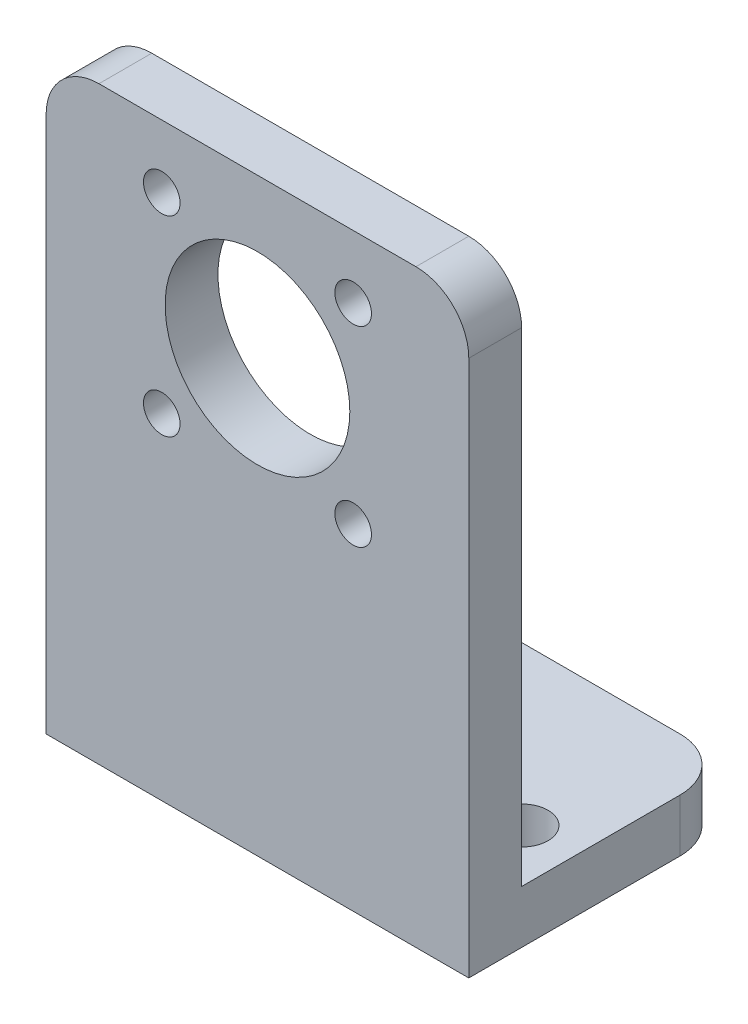
ISO-10303-21;
HEADER;
FILE_DESCRIPTION(('STEP AP214'),'2;1');
FILE_NAME('part.step','',(''),(''),'','','');
FILE_SCHEMA(('AUTOMOTIVE_DESIGN { 1 0 10303 214 1 1 1 1 }'));
ENDSEC;
DATA;
#1=APPLICATION_CONTEXT('core data for automotive mechanical design processes');
#2=APPLICATION_PROTOCOL_DEFINITION('international standard','automotive_design',2000,#1);
#3=PRODUCT_CONTEXT('',#1,'mechanical');
#4=PRODUCT('Part','Part','',(#3));
#5=PRODUCT_RELATED_PRODUCT_CATEGORY('part','',(#4));
#6=PRODUCT_DEFINITION_FORMATION('','',#4);
#7=PRODUCT_DEFINITION_CONTEXT('part definition',#1,'design');
#8=PRODUCT_DEFINITION('design','',#6,#7);
#9=PRODUCT_DEFINITION_SHAPE('','',#8);
#10=(LENGTH_UNIT() NAMED_UNIT(*) SI_UNIT(.MILLI.,.METRE.));
#11=(NAMED_UNIT(*) PLANE_ANGLE_UNIT() SI_UNIT($,.RADIAN.));
#12=(NAMED_UNIT(*) SI_UNIT($,.STERADIAN.) SOLID_ANGLE_UNIT());
#13=UNCERTAINTY_MEASURE_WITH_UNIT(LENGTH_MEASURE(1.E-05),#10,'distance_accuracy_value','');
#14=(GEOMETRIC_REPRESENTATION_CONTEXT(3) GLOBAL_UNCERTAINTY_ASSIGNED_CONTEXT((#13)) GLOBAL_UNIT_ASSIGNED_CONTEXT((#10,
#11,#12)) REPRESENTATION_CONTEXT('',''));
#15=CARTESIAN_POINT('',(0.,0.,0.));
#16=DIRECTION('',(0.,0.,1.));
#17=DIRECTION('',(1.,0.,0.));
#18=AXIS2_PLACEMENT_3D('',#15,#16,#17);
#19=CARTESIAN_POINT('',(0.,0.,0.));
#20=DIRECTION('',(0.,0.,1.));
#21=DIRECTION('',(1.,0.,0.));
#22=AXIS2_PLACEMENT_3D('',#19,#20,#21);
#23=PLANE('',#22);
#24=CARTESIAN_POINT('',(5.75,5.75,0.));
#25=DIRECTION('',(0.,0.,1.));
#26=DIRECTION('',(1.,0.,0.));
#27=AXIS2_PLACEMENT_3D('',#24,#25,#26);
#28=CIRCLE('',#27,1.1);
#29=CARTESIAN_POINT('',(6.85,5.75,0.));
#30=VERTEX_POINT('',#29);
#31=EDGE_CURVE('E355',#30,#30,#28,.T.);
#32=ORIENTED_EDGE('',*,*,#31,.T.);
#33=EDGE_LOOP('',(#32));
#34=FACE_BOUND('',#33,.T.);
#35=CARTESIAN_POINT('',(-5.75,5.75,0.));
#36=DIRECTION('',(0.,0.,1.));
#37=DIRECTION('',(1.,0.,0.));
#38=AXIS2_PLACEMENT_3D('',#35,#36,#37);
#39=CIRCLE('',#38,1.1);
#40=CARTESIAN_POINT('',(-4.65,5.75,0.));
#41=VERTEX_POINT('',#40);
#42=EDGE_CURVE('E39',#41,#41,#39,.T.);
#43=ORIENTED_EDGE('',*,*,#42,.T.);
#44=EDGE_LOOP('',(#43));
#45=FACE_BOUND('',#44,.T.);
#46=CARTESIAN_POINT('',(5.75,-5.75,0.));
#47=DIRECTION('',(0.,0.,1.));
#48=DIRECTION('',(1.,0.,0.));
#49=AXIS2_PLACEMENT_3D('',#46,#47,#48);
#50=CIRCLE('',#49,1.1);
#51=CARTESIAN_POINT('',(6.85,-5.75,0.));
#52=VERTEX_POINT('',#51);
#53=EDGE_CURVE('E345',#52,#52,#50,.T.);
#54=ORIENTED_EDGE('',*,*,#53,.T.);
#55=EDGE_LOOP('',(#54));
#56=FACE_BOUND('',#55,.T.);
#57=CARTESIAN_POINT('',(-5.75,-5.75,0.));
#58=DIRECTION('',(0.,0.,1.));
#59=DIRECTION('',(1.,0.,0.));
#60=AXIS2_PLACEMENT_3D('',#57,#58,#59);
#61=CIRCLE('',#60,1.1);
#62=CARTESIAN_POINT('',(-4.65,-5.75,0.));
#63=VERTEX_POINT('',#62);
#64=EDGE_CURVE('E140',#63,#63,#61,.T.);
#65=ORIENTED_EDGE('',*,*,#64,.T.);
#66=EDGE_LOOP('',(#65));
#67=FACE_BOUND('',#66,.T.);
#68=CARTESIAN_POINT('',(0.,0.,0.));
#69=DIRECTION('',(0.,0.,1.));
#70=DIRECTION('',(1.,0.,0.));
#71=AXIS2_PLACEMENT_3D('',#68,#69,#70);
#72=CIRCLE('',#71,5.55);
#73=CARTESIAN_POINT('',(5.55,0.,0.));
#74=VERTEX_POINT('',#73);
#75=EDGE_CURVE('E150',#74,#74,#72,.T.);
#76=ORIENTED_EDGE('',*,*,#75,.T.);
#77=EDGE_LOOP('',(#76));
#78=FACE_BOUND('',#77,.T.);
#79=DIRECTION('',(0.,-1.,0.));
#80=VECTOR('',#79,1.);
#81=CARTESIAN_POINT('',(-12.7,9.525,0.));
#82=LINE('',#81,#80);
#83=CARTESIAN_POINT('',(-12.7,6.35,0.));
#84=VERTEX_POINT('',#83);
#85=CARTESIAN_POINT('',(-12.7,-22.733,0.));
#86=VERTEX_POINT('',#85);
#87=EDGE_CURVE('E134',#84,#86,#82,.T.);
#88=ORIENTED_EDGE('',*,*,#87,.F.);
#89=CARTESIAN_POINT('',(-9.525,6.35,0.));
#90=DIRECTION('',(0.,0.,1.));
#91=DIRECTION('',(1.,0.,0.));
#92=AXIS2_PLACEMENT_3D('',#89,#90,#91);
#93=CIRCLE('',#92,3.175);
#94=CARTESIAN_POINT('',(-9.525,9.525,0.));
#95=VERTEX_POINT('',#94);
#96=EDGE_CURVE('E194',#84,#95,#93,.F.);
#97=ORIENTED_EDGE('',*,*,#96,.T.);
#98=DIRECTION('',(-1.,0.,0.));
#99=VECTOR('',#98,1.);
#100=CARTESIAN_POINT('',(-12.7,9.525,0.));
#101=LINE('',#100,#99);
#102=CARTESIAN_POINT('',(9.525,9.525,0.));
#103=VERTEX_POINT('',#102);
#104=EDGE_CURVE('E133',#103,#95,#101,.T.);
#105=ORIENTED_EDGE('',*,*,#104,.F.);
#106=CARTESIAN_POINT('',(9.525,6.35,0.));
#107=DIRECTION('',(0.,0.,1.));
#108=DIRECTION('',(1.,0.,0.));
#109=AXIS2_PLACEMENT_3D('',#106,#107,#108);
#110=CIRCLE('',#109,3.175);
#111=CARTESIAN_POINT('',(12.7,6.35,0.));
#112=VERTEX_POINT('',#111);
#113=EDGE_CURVE('E132',#103,#112,#110,.F.);
#114=ORIENTED_EDGE('',*,*,#113,.T.);
#115=DIRECTION('',(0.,1.,0.));
#116=VECTOR('',#115,1.);
#117=CARTESIAN_POINT('',(12.7,9.525,0.));
#118=LINE('',#117,#116);
#119=CARTESIAN_POINT('',(12.7,-22.733,0.));
#120=VERTEX_POINT('',#119);
#121=EDGE_CURVE('E117',#120,#112,#118,.T.);
#122=ORIENTED_EDGE('',*,*,#121,.F.);
#123=DIRECTION('',(1.,0.,0.));
#124=VECTOR('',#123,1.);
#125=CARTESIAN_POINT('',(-12.7,-22.733,0.));
#126=LINE('',#125,#124);
#127=EDGE_CURVE('E130',#86,#120,#126,.T.);
#128=ORIENTED_EDGE('',*,*,#127,.F.);
#129=EDGE_LOOP('',(#88,#97,#105,#114,#122,#128));
#130=FACE_BOUND('',#129,.T.);
#131=ADVANCED_FACE('F35',(#34,#45,#56,#67,#78,#130),#23,.F.);
#132=CARTESIAN_POINT('',(0.,0.,3.175));
#133=DIRECTION('',(0.,0.,1.));
#134=DIRECTION('',(1.,0.,0.));
#135=AXIS2_PLACEMENT_3D('',#132,#133,#134);
#136=PLANE('',#135);
#137=CARTESIAN_POINT('',(5.75,5.75,3.175));
#138=DIRECTION('',(0.,0.,1.));
#139=DIRECTION('',(1.,0.,0.));
#140=AXIS2_PLACEMENT_3D('',#137,#138,#139);
#141=CIRCLE('',#140,1.1);
#142=CARTESIAN_POINT('',(6.85,5.75,3.175));
#143=VERTEX_POINT('',#142);
#144=EDGE_CURVE('E357',#143,#143,#141,.T.);
#145=ORIENTED_EDGE('',*,*,#144,.F.);
#146=EDGE_LOOP('',(#145));
#147=FACE_BOUND('',#146,.T.);
#148=CARTESIAN_POINT('',(-5.75,5.75,3.175));
#149=DIRECTION('',(0.,0.,1.));
#150=DIRECTION('',(1.,0.,0.));
#151=AXIS2_PLACEMENT_3D('',#148,#149,#150);
#152=CIRCLE('',#151,1.1);
#153=CARTESIAN_POINT('',(-4.65,5.75,3.175));
#154=VERTEX_POINT('',#153);
#155=EDGE_CURVE('E352',#154,#154,#152,.T.);
#156=ORIENTED_EDGE('',*,*,#155,.F.);
#157=EDGE_LOOP('',(#156));
#158=FACE_BOUND('',#157,.T.);
#159=CARTESIAN_POINT('',(5.75,-5.75,3.175));
#160=DIRECTION('',(0.,0.,1.));
#161=DIRECTION('',(1.,0.,0.));
#162=AXIS2_PLACEMENT_3D('',#159,#160,#161);
#163=CIRCLE('',#162,1.1);
#164=CARTESIAN_POINT('',(6.85,-5.75,3.175));
#165=VERTEX_POINT('',#164);
#166=EDGE_CURVE('E342',#165,#165,#163,.T.);
#167=ORIENTED_EDGE('',*,*,#166,.F.);
#168=EDGE_LOOP('',(#167));
#169=FACE_BOUND('',#168,.T.);
#170=CARTESIAN_POINT('',(-5.75,-5.75,3.175));
#171=DIRECTION('',(0.,0.,1.));
#172=DIRECTION('',(1.,0.,0.));
#173=AXIS2_PLACEMENT_3D('',#170,#171,#172);
#174=CIRCLE('',#173,1.1);
#175=CARTESIAN_POINT('',(-4.65,-5.75,3.175));
#176=VERTEX_POINT('',#175);
#177=EDGE_CURVE('E145',#176,#176,#174,.T.);
#178=ORIENTED_EDGE('',*,*,#177,.F.);
#179=EDGE_LOOP('',(#178));
#180=FACE_BOUND('',#179,.T.);
#181=DIRECTION('',(-1.,0.,0.));
#182=VECTOR('',#181,1.);
#183=CARTESIAN_POINT('',(-12.7,9.525,3.175));
#184=LINE('',#183,#182);
#185=CARTESIAN_POINT('',(9.525,9.525,3.175));
#186=VERTEX_POINT('',#185);
#187=CARTESIAN_POINT('',(-9.525,9.525,3.175));
#188=VERTEX_POINT('',#187);
#189=EDGE_CURVE('E162',#186,#188,#184,.T.);
#190=ORIENTED_EDGE('',*,*,#189,.T.);
#191=CARTESIAN_POINT('',(-9.525,6.35,3.175));
#192=DIRECTION('',(0.,0.,1.));
#193=DIRECTION('',(1.,0.,0.));
#194=AXIS2_PLACEMENT_3D('',#191,#192,#193);
#195=CIRCLE('',#194,3.175);
#196=CARTESIAN_POINT('',(-12.7,6.35,3.175));
#197=VERTEX_POINT('',#196);
#198=EDGE_CURVE('E11',#188,#197,#195,.T.);
#199=ORIENTED_EDGE('',*,*,#198,.T.);
#200=DIRECTION('',(0.,-1.,0.));
#201=VECTOR('',#200,1.);
#202=CARTESIAN_POINT('',(-12.7,9.525,3.175));
#203=LINE('',#202,#201);
#204=CARTESIAN_POINT('',(-12.7,-25.908,3.175));
#205=VERTEX_POINT('',#204);
#206=EDGE_CURVE('E156',#197,#205,#203,.T.);
#207=ORIENTED_EDGE('',*,*,#206,.T.);
#208=DIRECTION('',(1.,0.,0.));
#209=VECTOR('',#208,1.);
#210=CARTESIAN_POINT('',(-12.7,-25.908,3.175));
#211=LINE('',#210,#209);
#212=CARTESIAN_POINT('',(12.7,-25.908,3.175));
#213=VERTEX_POINT('',#212);
#214=EDGE_CURVE('E158',#205,#213,#211,.T.);
#215=ORIENTED_EDGE('',*,*,#214,.T.);
#216=DIRECTION('',(0.,1.,0.));
#217=VECTOR('',#216,1.);
#218=CARTESIAN_POINT('',(12.7,9.525,3.175));
#219=LINE('',#218,#217);
#220=CARTESIAN_POINT('',(12.7,6.35,3.175));
#221=VERTEX_POINT('',#220);
#222=EDGE_CURVE('E160',#213,#221,#219,.T.);
#223=ORIENTED_EDGE('',*,*,#222,.T.);
#224=CARTESIAN_POINT('',(9.525,6.35,3.175));
#225=DIRECTION('',(0.,0.,1.));
#226=DIRECTION('',(1.,0.,0.));
#227=AXIS2_PLACEMENT_3D('',#224,#225,#226);
#228=CIRCLE('',#227,3.175);
#229=EDGE_CURVE('E44',#221,#186,#228,.T.);
#230=ORIENTED_EDGE('',*,*,#229,.T.);
#231=EDGE_LOOP('',(#190,#199,#207,#215,#223,#230));
#232=FACE_BOUND('',#231,.T.);
#233=CARTESIAN_POINT('',(0.,0.,3.175));
#234=DIRECTION('',(0.,0.,1.));
#235=DIRECTION('',(1.,0.,0.));
#236=AXIS2_PLACEMENT_3D('',#233,#234,#235);
#237=CIRCLE('',#236,5.55);
#238=CARTESIAN_POINT('',(5.55,0.,3.175));
#239=VERTEX_POINT('',#238);
#240=EDGE_CURVE('E151',#239,#239,#237,.T.);
#241=ORIENTED_EDGE('',*,*,#240,.F.);
#242=EDGE_LOOP('',(#241));
#243=FACE_BOUND('',#242,.T.);
#244=ADVANCED_FACE('F212',(#147,#158,#169,#180,#232,#243),#136,.T.);
#245=CARTESIAN_POINT('',(-12.7,9.525,3.175));
#246=DIRECTION('',(1.,0.,0.));
#247=DIRECTION('',(0.,1.,0.));
#248=AXIS2_PLACEMENT_3D('',#245,#246,#247);
#249=PLANE('',#248);
#250=DIRECTION('',(0.,0.,1.));
#251=VECTOR('',#250,1.);
#252=CARTESIAN_POINT('',(-12.7,-22.733,-12.7));
#253=LINE('',#252,#251);
#254=CARTESIAN_POINT('',(-12.7,-22.733,-9.525));
#255=VERTEX_POINT('',#254);
#256=EDGE_CURVE('E124',#255,#86,#253,.T.);
#257=ORIENTED_EDGE('',*,*,#256,.F.);
#258=DIRECTION('',(0.,1.,0.));
#259=VECTOR('',#258,1.);
#260=CARTESIAN_POINT('',(-12.7,-25.908,-9.525));
#261=LINE('',#260,#259);
#262=CARTESIAN_POINT('',(-12.7,-25.908,-9.525));
#263=VERTEX_POINT('',#262);
#264=EDGE_CURVE('E191',#255,#263,#261,.F.);
#265=ORIENTED_EDGE('',*,*,#264,.T.);
#266=DIRECTION('',(0.,0.,-1.));
#267=VECTOR('',#266,1.);
#268=CARTESIAN_POINT('',(-12.7,-25.908,3.175));
#269=LINE('',#268,#267);
#270=EDGE_CURVE('E168',#205,#263,#269,.T.);
#271=ORIENTED_EDGE('',*,*,#270,.F.);
#272=ORIENTED_EDGE('',*,*,#206,.F.);
#273=DIRECTION('',(0.,0.,-1.));
#274=VECTOR('',#273,1.);
#275=CARTESIAN_POINT('',(-12.7,6.35,3.175));
#276=LINE('',#275,#274);
#277=EDGE_CURVE('E188',#197,#84,#276,.T.);
#278=ORIENTED_EDGE('',*,*,#277,.T.);
#279=ORIENTED_EDGE('',*,*,#87,.T.);
#280=EDGE_LOOP('',(#257,#265,#271,#272,#278,#279));
#281=FACE_BOUND('',#280,.T.);
#282=ADVANCED_FACE('F209',(#281),#249,.F.);
#283=CARTESIAN_POINT('',(-12.7,-25.908,3.175));
#284=DIRECTION('',(0.,1.,0.));
#285=DIRECTION('',(-1.,0.,0.));
#286=AXIS2_PLACEMENT_3D('',#283,#284,#285);
#287=PLANE('',#286);
#288=CARTESIAN_POINT('',(9.525,-25.908,-3.175));
#289=DIRECTION('',(0.,1.,0.));
#290=DIRECTION('',(-1.,0.,0.));
#291=AXIS2_PLACEMENT_3D('',#288,#289,#290);
#292=CIRCLE('',#291,1.5875);
#293=CARTESIAN_POINT('',(7.9375,-25.908,-3.175));
#294=VERTEX_POINT('',#293);
#295=EDGE_CURVE('E372',#294,#294,#292,.T.);
#296=ORIENTED_EDGE('',*,*,#295,.T.);
#297=EDGE_LOOP('',(#296));
#298=FACE_BOUND('',#297,.T.);
#299=CARTESIAN_POINT('',(-9.525,-25.908,-3.175));
#300=DIRECTION('',(0.,1.,0.));
#301=DIRECTION('',(-1.,0.,0.));
#302=AXIS2_PLACEMENT_3D('',#299,#300,#301);
#303=CIRCLE('',#302,1.5875);
#304=CARTESIAN_POINT('',(-11.1125,-25.908,-3.175));
#305=VERTEX_POINT('',#304);
#306=EDGE_CURVE('E366',#305,#305,#303,.T.);
#307=ORIENTED_EDGE('',*,*,#306,.T.);
#308=EDGE_LOOP('',(#307));
#309=FACE_BOUND('',#308,.T.);
#310=CARTESIAN_POINT('',(0.,-25.908,-9.525));
#311=DIRECTION('',(0.,1.,0.));
#312=DIRECTION('',(0.,0.,1.));
#313=AXIS2_PLACEMENT_3D('',#310,#311,#312);
#314=CIRCLE('',#313,1.47319999999999);
#315=CARTESIAN_POINT('',(0.,-25.908,-8.05180000000001));
#316=VERTEX_POINT('',#315);
#317=EDGE_CURVE('E360',#316,#316,#314,.T.);
#318=ORIENTED_EDGE('',*,*,#317,.T.);
#319=EDGE_LOOP('',(#318));
#320=FACE_BOUND('',#319,.T.);
#321=DIRECTION('',(-1.,0.,0.));
#322=VECTOR('',#321,1.);
#323=CARTESIAN_POINT('',(-12.7,-25.908,-12.7));
#324=LINE('',#323,#322);
#325=CARTESIAN_POINT('',(9.525,-25.908,-12.7));
#326=VERTEX_POINT('',#325);
#327=CARTESIAN_POINT('',(-9.525,-25.908,-12.7));
#328=VERTEX_POINT('',#327);
#329=EDGE_CURVE('E125',#326,#328,#324,.T.);
#330=ORIENTED_EDGE('',*,*,#329,.F.);
#331=CARTESIAN_POINT('',(9.525,-25.908,-9.525));
#332=DIRECTION('',(0.,1.,0.));
#333=DIRECTION('',(-1.,0.,0.));
#334=AXIS2_PLACEMENT_3D('',#331,#332,#333);
#335=CIRCLE('',#334,3.175);
#336=CARTESIAN_POINT('',(12.7,-25.908,-9.525));
#337=VERTEX_POINT('',#336);
#338=EDGE_CURVE('E179',#326,#337,#335,.F.);
#339=ORIENTED_EDGE('',*,*,#338,.T.);
#340=DIRECTION('',(0.,0.,-1.));
#341=VECTOR('',#340,1.);
#342=CARTESIAN_POINT('',(12.7,-25.908,3.175));
#343=LINE('',#342,#341);
#344=EDGE_CURVE('E164',#213,#337,#343,.T.);
#345=ORIENTED_EDGE('',*,*,#344,.F.);
#346=ORIENTED_EDGE('',*,*,#214,.F.);
#347=ORIENTED_EDGE('',*,*,#270,.T.);
#348=CARTESIAN_POINT('',(-9.525,-25.908,-9.525));
#349=DIRECTION('',(0.,1.,0.));
#350=DIRECTION('',(-1.,0.,0.));
#351=AXIS2_PLACEMENT_3D('',#348,#349,#350);
#352=CIRCLE('',#351,3.175);
#353=EDGE_CURVE('E177',#263,#328,#352,.F.);
#354=ORIENTED_EDGE('',*,*,#353,.T.);
#355=EDGE_LOOP('',(#330,#339,#345,#346,#347,#354));
#356=FACE_BOUND('',#355,.T.);
#357=ADVANCED_FACE('F217',(#298,#309,#320,#356),#287,.F.);
#358=CARTESIAN_POINT('',(12.7,9.525,3.175));
#359=DIRECTION('',(-1.,0.,0.));
#360=DIRECTION('',(0.,-1.,0.));
#361=AXIS2_PLACEMENT_3D('',#358,#359,#360);
#362=PLANE('',#361);
#363=ORIENTED_EDGE('',*,*,#344,.T.);
#364=DIRECTION('',(0.,-1.,0.));
#365=VECTOR('',#364,1.);
#366=CARTESIAN_POINT('',(12.7,-22.733,-9.525));
#367=LINE('',#366,#365);
#368=CARTESIAN_POINT('',(12.7,-22.733,-9.525));
#369=VERTEX_POINT('',#368);
#370=EDGE_CURVE('E120',#337,#369,#367,.F.);
#371=ORIENTED_EDGE('',*,*,#370,.T.);
#372=DIRECTION('',(0.,0.,1.));
#373=VECTOR('',#372,1.);
#374=CARTESIAN_POINT('',(12.7,-22.733,-12.7));
#375=LINE('',#374,#373);
#376=EDGE_CURVE('E113',#369,#120,#375,.T.);
#377=ORIENTED_EDGE('',*,*,#376,.T.);
#378=ORIENTED_EDGE('',*,*,#121,.T.);
#379=DIRECTION('',(0.,0.,-1.));
#380=VECTOR('',#379,1.);
#381=CARTESIAN_POINT('',(12.7,6.35,3.175));
#382=LINE('',#381,#380);
#383=EDGE_CURVE('E181',#112,#221,#382,.F.);
#384=ORIENTED_EDGE('',*,*,#383,.T.);
#385=ORIENTED_EDGE('',*,*,#222,.F.);
#386=EDGE_LOOP('',(#363,#371,#377,#378,#384,#385));
#387=FACE_BOUND('',#386,.T.);
#388=ADVANCED_FACE('F116',(#387),#362,.F.);
#389=CARTESIAN_POINT('',(-12.7,9.525,3.175));
#390=DIRECTION('',(0.,-1.,0.));
#391=DIRECTION('',(1.,0.,0.));
#392=AXIS2_PLACEMENT_3D('',#389,#390,#391);
#393=PLANE('',#392);
#394=ORIENTED_EDGE('',*,*,#104,.T.);
#395=DIRECTION('',(0.,0.,-1.));
#396=VECTOR('',#395,1.);
#397=CARTESIAN_POINT('',(-9.525,9.525,3.175));
#398=LINE('',#397,#396);
#399=EDGE_CURVE('E51',#95,#188,#398,.F.);
#400=ORIENTED_EDGE('',*,*,#399,.T.);
#401=ORIENTED_EDGE('',*,*,#189,.F.);
#402=DIRECTION('',(0.,0.,-1.));
#403=VECTOR('',#402,1.);
#404=CARTESIAN_POINT('',(9.525,9.525,3.175));
#405=LINE('',#404,#403);
#406=EDGE_CURVE('E196',#186,#103,#405,.T.);
#407=ORIENTED_EDGE('',*,*,#406,.T.);
#408=EDGE_LOOP('',(#394,#400,#401,#407));
#409=FACE_BOUND('',#408,.T.);
#410=ADVANCED_FACE('F201',(#409),#393,.F.);
#411=CARTESIAN_POINT('',(0.,0.,3.175));
#412=DIRECTION('',(0.,0.,-1.));
#413=DIRECTION('',(-1.,0.,0.));
#414=AXIS2_PLACEMENT_3D('',#411,#412,#413);
#415=CYLINDRICAL_SURFACE('',#414,5.55);
#416=ORIENTED_EDGE('',*,*,#240,.T.);
#417=EDGE_LOOP('',(#416));
#418=FACE_BOUND('',#417,.T.);
#419=ORIENTED_EDGE('',*,*,#75,.F.);
#420=EDGE_LOOP('',(#419));
#421=FACE_BOUND('',#420,.T.);
#422=ADVANCED_FACE('F244',(#418,#421),#415,.F.);
#423=CARTESIAN_POINT('',(-12.7,-22.733,-12.7));
#424=DIRECTION('',(0.,-1.,0.));
#425=DIRECTION('',(1.,0.,0.));
#426=AXIS2_PLACEMENT_3D('',#423,#424,#425);
#427=PLANE('',#426);
#428=CARTESIAN_POINT('',(9.525,-22.733,-3.175));
#429=DIRECTION('',(0.,1.,0.));
#430=DIRECTION('',(0.,0.,1.));
#431=AXIS2_PLACEMENT_3D('',#428,#429,#430);
#432=CIRCLE('',#431,1.5875);
#433=CARTESIAN_POINT('',(9.525,-22.733,-1.5875));
#434=VERTEX_POINT('',#433);
#435=EDGE_CURVE('E375',#434,#434,#432,.T.);
#436=ORIENTED_EDGE('',*,*,#435,.F.);
#437=EDGE_LOOP('',(#436));
#438=FACE_BOUND('',#437,.T.);
#439=CARTESIAN_POINT('',(-9.525,-22.733,-3.175));
#440=DIRECTION('',(0.,1.,0.));
#441=DIRECTION('',(0.,0.,1.));
#442=AXIS2_PLACEMENT_3D('',#439,#440,#441);
#443=CIRCLE('',#442,1.5875);
#444=CARTESIAN_POINT('',(-9.525,-22.733,-1.5875));
#445=VERTEX_POINT('',#444);
#446=EDGE_CURVE('E369',#445,#445,#443,.T.);
#447=ORIENTED_EDGE('',*,*,#446,.F.);
#448=EDGE_LOOP('',(#447));
#449=FACE_BOUND('',#448,.T.);
#450=CARTESIAN_POINT('',(0.,-22.733,-9.525));
#451=DIRECTION('',(0.,1.,0.));
#452=DIRECTION('',(0.,0.,1.));
#453=AXIS2_PLACEMENT_3D('',#450,#451,#452);
#454=CIRCLE('',#453,1.47319999999999);
#455=CARTESIAN_POINT('',(0.,-22.733,-8.05180000000001));
#456=VERTEX_POINT('',#455);
#457=EDGE_CURVE('E363',#456,#456,#454,.T.);
#458=ORIENTED_EDGE('',*,*,#457,.F.);
#459=EDGE_LOOP('',(#458));
#460=FACE_BOUND('',#459,.T.);
#461=ORIENTED_EDGE('',*,*,#376,.F.);
#462=CARTESIAN_POINT('',(9.525,-22.733,-9.525));
#463=DIRECTION('',(0.,-1.,0.));
#464=DIRECTION('',(1.,0.,0.));
#465=AXIS2_PLACEMENT_3D('',#462,#463,#464);
#466=CIRCLE('',#465,3.175);
#467=CARTESIAN_POINT('',(9.525,-22.733,-12.7));
#468=VERTEX_POINT('',#467);
#469=EDGE_CURVE('E186',#369,#468,#466,.F.);
#470=ORIENTED_EDGE('',*,*,#469,.T.);
#471=DIRECTION('',(1.,0.,0.));
#472=VECTOR('',#471,1.);
#473=CARTESIAN_POINT('',(-12.7,-22.733,-12.7));
#474=LINE('',#473,#472);
#475=CARTESIAN_POINT('',(-9.525,-22.733,-12.7));
#476=VERTEX_POINT('',#475);
#477=EDGE_CURVE('E139',#476,#468,#474,.T.);
#478=ORIENTED_EDGE('',*,*,#477,.F.);
#479=CARTESIAN_POINT('',(-9.525,-22.733,-9.525));
#480=DIRECTION('',(0.,-1.,0.));
#481=DIRECTION('',(1.,0.,0.));
#482=AXIS2_PLACEMENT_3D('',#479,#480,#481);
#483=CIRCLE('',#482,3.175);
#484=EDGE_CURVE('E184',#476,#255,#483,.F.);
#485=ORIENTED_EDGE('',*,*,#484,.T.);
#486=ORIENTED_EDGE('',*,*,#256,.T.);
#487=ORIENTED_EDGE('',*,*,#127,.T.);
#488=EDGE_LOOP('',(#461,#470,#478,#485,#486,#487));
#489=FACE_BOUND('',#488,.T.);
#490=ADVANCED_FACE('F137',(#438,#449,#460,#489),#427,.F.);
#491=CARTESIAN_POINT('',(0.,0.,-12.7));
#492=DIRECTION('',(0.,0.,-1.));
#493=DIRECTION('',(-1.,0.,0.));
#494=AXIS2_PLACEMENT_3D('',#491,#492,#493);
#495=PLANE('',#494);
#496=ORIENTED_EDGE('',*,*,#477,.T.);
#497=DIRECTION('',(0.,-1.,0.));
#498=VECTOR('',#497,1.);
#499=CARTESIAN_POINT('',(9.525,-25.908,-12.7));
#500=LINE('',#499,#498);
#501=EDGE_CURVE('E174',#468,#326,#500,.T.);
#502=ORIENTED_EDGE('',*,*,#501,.T.);
#503=ORIENTED_EDGE('',*,*,#329,.T.);
#504=DIRECTION('',(0.,1.,0.));
#505=VECTOR('',#504,1.);
#506=CARTESIAN_POINT('',(-9.525,-22.733,-12.7));
#507=LINE('',#506,#505);
#508=EDGE_CURVE('E171',#328,#476,#507,.T.);
#509=ORIENTED_EDGE('',*,*,#508,.T.);
#510=EDGE_LOOP('',(#496,#502,#503,#509));
#511=FACE_BOUND('',#510,.T.);
#512=ADVANCED_FACE('F255',(#511),#495,.T.);
#513=CARTESIAN_POINT('',(9.525,0.,-9.525));
#514=DIRECTION('',(0.,1.,0.));
#515=DIRECTION('',(-1.,0.,0.));
#516=AXIS2_PLACEMENT_3D('',#513,#514,#515);
#517=CYLINDRICAL_SURFACE('',#516,3.175);
#518=ORIENTED_EDGE('',*,*,#469,.F.);
#519=ORIENTED_EDGE('',*,*,#370,.F.);
#520=ORIENTED_EDGE('',*,*,#338,.F.);
#521=ORIENTED_EDGE('',*,*,#501,.F.);
#522=EDGE_LOOP('',(#518,#519,#520,#521));
#523=FACE_BOUND('',#522,.T.);
#524=ADVANCED_FACE('F252',(#523),#517,.T.);
#525=CARTESIAN_POINT('',(-9.525,0.,-9.525));
#526=DIRECTION('',(0.,-1.,0.));
#527=DIRECTION('',(1.,0.,0.));
#528=AXIS2_PLACEMENT_3D('',#525,#526,#527);
#529=CYLINDRICAL_SURFACE('',#528,3.175);
#530=ORIENTED_EDGE('',*,*,#353,.F.);
#531=ORIENTED_EDGE('',*,*,#264,.F.);
#532=ORIENTED_EDGE('',*,*,#484,.F.);
#533=ORIENTED_EDGE('',*,*,#508,.F.);
#534=EDGE_LOOP('',(#530,#531,#532,#533));
#535=FACE_BOUND('',#534,.T.);
#536=ADVANCED_FACE('F229',(#535),#529,.T.);
#537=CARTESIAN_POINT('',(-9.525,6.35,3.175));
#538=DIRECTION('',(0.,0.,-1.));
#539=DIRECTION('',(-1.,0.,0.));
#540=AXIS2_PLACEMENT_3D('',#537,#538,#539);
#541=CYLINDRICAL_SURFACE('',#540,3.175);
#542=ORIENTED_EDGE('',*,*,#198,.F.);
#543=ORIENTED_EDGE('',*,*,#399,.F.);
#544=ORIENTED_EDGE('',*,*,#96,.F.);
#545=ORIENTED_EDGE('',*,*,#277,.F.);
#546=EDGE_LOOP('',(#542,#543,#544,#545));
#547=FACE_BOUND('',#546,.T.);
#548=ADVANCED_FACE('F206',(#547),#541,.T.);
#549=CARTESIAN_POINT('',(9.525,6.35,3.175));
#550=DIRECTION('',(0.,0.,-1.));
#551=DIRECTION('',(-1.,0.,0.));
#552=AXIS2_PLACEMENT_3D('',#549,#550,#551);
#553=CYLINDRICAL_SURFACE('',#552,3.175);
#554=ORIENTED_EDGE('',*,*,#229,.F.);
#555=ORIENTED_EDGE('',*,*,#383,.F.);
#556=ORIENTED_EDGE('',*,*,#113,.F.);
#557=ORIENTED_EDGE('',*,*,#406,.F.);
#558=EDGE_LOOP('',(#554,#555,#556,#557));
#559=FACE_BOUND('',#558,.T.);
#560=ADVANCED_FACE('F37',(#559),#553,.T.);
#561=CARTESIAN_POINT('',(-5.75,-5.75,3.175));
#562=DIRECTION('',(0.,0.,1.));
#563=DIRECTION('',(1.,0.,0.));
#564=AXIS2_PLACEMENT_3D('',#561,#562,#563);
#565=CYLINDRICAL_SURFACE('',#564,1.1);
#566=ORIENTED_EDGE('',*,*,#177,.T.);
#567=EDGE_LOOP('',(#566));
#568=FACE_BOUND('',#567,.T.);
#569=ORIENTED_EDGE('',*,*,#64,.F.);
#570=EDGE_LOOP('',(#569));
#571=FACE_BOUND('',#570,.T.);
#572=ADVANCED_FACE('F221',(#568,#571),#565,.F.);
#573=CARTESIAN_POINT('',(5.75,-5.75,3.175));
#574=DIRECTION('',(0.,0.,1.));
#575=DIRECTION('',(1.,0.,0.));
#576=AXIS2_PLACEMENT_3D('',#573,#574,#575);
#577=CYLINDRICAL_SURFACE('',#576,1.1);
#578=ORIENTED_EDGE('',*,*,#166,.T.);
#579=EDGE_LOOP('',(#578));
#580=FACE_BOUND('',#579,.T.);
#581=ORIENTED_EDGE('',*,*,#53,.F.);
#582=EDGE_LOOP('',(#581));
#583=FACE_BOUND('',#582,.T.);
#584=ADVANCED_FACE('F226',(#580,#583),#577,.F.);
#585=CARTESIAN_POINT('',(-5.75,5.75,3.175));
#586=DIRECTION('',(0.,0.,1.));
#587=DIRECTION('',(1.,0.,0.));
#588=AXIS2_PLACEMENT_3D('',#585,#586,#587);
#589=CYLINDRICAL_SURFACE('',#588,1.1);
#590=ORIENTED_EDGE('',*,*,#155,.T.);
#591=EDGE_LOOP('',(#590));
#592=FACE_BOUND('',#591,.T.);
#593=ORIENTED_EDGE('',*,*,#42,.F.);
#594=EDGE_LOOP('',(#593));
#595=FACE_BOUND('',#594,.T.);
#596=ADVANCED_FACE('F331',(#592,#595),#589,.F.);
#597=CARTESIAN_POINT('',(5.75,5.75,3.175));
#598=DIRECTION('',(0.,0.,1.));
#599=DIRECTION('',(1.,0.,0.));
#600=AXIS2_PLACEMENT_3D('',#597,#598,#599);
#601=CYLINDRICAL_SURFACE('',#600,1.1);
#602=ORIENTED_EDGE('',*,*,#144,.T.);
#603=EDGE_LOOP('',(#602));
#604=FACE_BOUND('',#603,.T.);
#605=ORIENTED_EDGE('',*,*,#31,.F.);
#606=EDGE_LOOP('',(#605));
#607=FACE_BOUND('',#606,.T.);
#608=ADVANCED_FACE('F327',(#604,#607),#601,.F.);
#609=CARTESIAN_POINT('',(0.,-22.733,-9.525));
#610=DIRECTION('',(0.,1.,0.));
#611=DIRECTION('',(0.,0.,1.));
#612=AXIS2_PLACEMENT_3D('',#609,#610,#611);
#613=CYLINDRICAL_SURFACE('',#612,1.47319999999999);
#614=ORIENTED_EDGE('',*,*,#317,.F.);
#615=EDGE_LOOP('',(#614));
#616=FACE_BOUND('',#615,.T.);
#617=ORIENTED_EDGE('',*,*,#457,.T.);
#618=EDGE_LOOP('',(#617));
#619=FACE_BOUND('',#618,.T.);
#620=ADVANCED_FACE('F307',(#616,#619),#613,.F.);
#621=CARTESIAN_POINT('',(-9.525,-22.733,-3.175));
#622=DIRECTION('',(0.,1.,0.));
#623=DIRECTION('',(0.,0.,1.));
#624=AXIS2_PLACEMENT_3D('',#621,#622,#623);
#625=CYLINDRICAL_SURFACE('',#624,1.5875);
#626=ORIENTED_EDGE('',*,*,#446,.T.);
#627=EDGE_LOOP('',(#626));
#628=FACE_BOUND('',#627,.T.);
#629=ORIENTED_EDGE('',*,*,#306,.F.);
#630=EDGE_LOOP('',(#629));
#631=FACE_BOUND('',#630,.T.);
#632=ADVANCED_FACE('F301',(#628,#631),#625,.F.);
#633=CARTESIAN_POINT('',(9.525,-22.733,-3.175));
#634=DIRECTION('',(0.,1.,0.));
#635=DIRECTION('',(0.,0.,1.));
#636=AXIS2_PLACEMENT_3D('',#633,#634,#635);
#637=CYLINDRICAL_SURFACE('',#636,1.5875);
#638=ORIENTED_EDGE('',*,*,#435,.T.);
#639=EDGE_LOOP('',(#638));
#640=FACE_BOUND('',#639,.T.);
#641=ORIENTED_EDGE('',*,*,#295,.F.);
#642=EDGE_LOOP('',(#641));
#643=FACE_BOUND('',#642,.T.);
#644=ADVANCED_FACE('F306',(#640,#643),#637,.F.);
#645=CLOSED_SHELL('',(#131,#244,#282,#357,#388,#410,#422,#490,#512,#524,#536,#548,#560,#572,
#584,#596,#608,#620,#632,#644));
#646=MANIFOLD_SOLID_BREP('B2',#645);
#647=ADVANCED_BREP_SHAPE_REPRESENTATION('',(#18,#646),#14);
#648=SHAPE_DEFINITION_REPRESENTATION(#9,#647);
ENDSEC;
END-ISO-10303-21;
